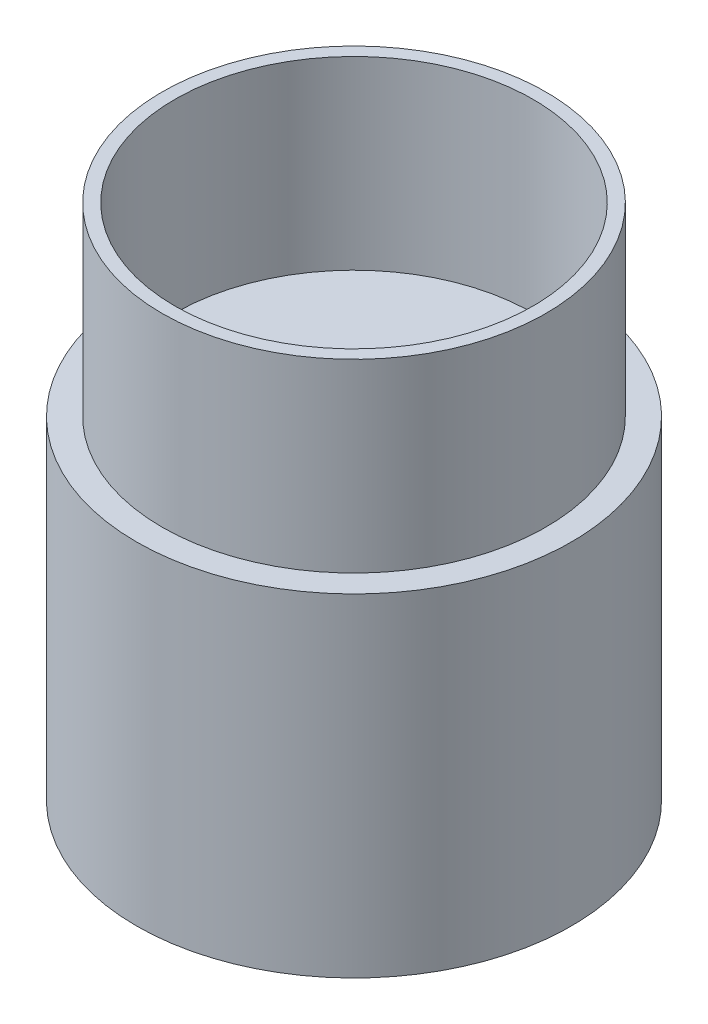
ISO-10303-21;
HEADER;
FILE_DESCRIPTION(('STEP AP214'),'2;1');
FILE_NAME('part.step','',(''),(''),'','','');
FILE_SCHEMA(('AUTOMOTIVE_DESIGN { 1 0 10303 214 1 1 1 1 }'));
ENDSEC;
DATA;
#1=APPLICATION_CONTEXT('core data for automotive mechanical design processes');
#2=APPLICATION_PROTOCOL_DEFINITION('international standard','automotive_design',2000,#1);
#3=PRODUCT_CONTEXT('',#1,'mechanical');
#4=PRODUCT('Part','Part','',(#3));
#5=PRODUCT_RELATED_PRODUCT_CATEGORY('part','',(#4));
#6=PRODUCT_DEFINITION_FORMATION('','',#4);
#7=PRODUCT_DEFINITION_CONTEXT('part definition',#1,'design');
#8=PRODUCT_DEFINITION('design','',#6,#7);
#9=PRODUCT_DEFINITION_SHAPE('','',#8);
#10=(LENGTH_UNIT() NAMED_UNIT(*) SI_UNIT(.MILLI.,.METRE.));
#11=(NAMED_UNIT(*) PLANE_ANGLE_UNIT() SI_UNIT($,.RADIAN.));
#12=(NAMED_UNIT(*) SI_UNIT($,.STERADIAN.) SOLID_ANGLE_UNIT());
#13=UNCERTAINTY_MEASURE_WITH_UNIT(LENGTH_MEASURE(1.E-05),#10,'distance_accuracy_value','');
#14=(GEOMETRIC_REPRESENTATION_CONTEXT(3) GLOBAL_UNCERTAINTY_ASSIGNED_CONTEXT((#13)) GLOBAL_UNIT_ASSIGNED_CONTEXT((#10,
#11,#12)) REPRESENTATION_CONTEXT('',''));
#15=CARTESIAN_POINT('',(0.,0.,0.));
#16=DIRECTION('',(0.,0.,1.));
#17=DIRECTION('',(1.,0.,0.));
#18=AXIS2_PLACEMENT_3D('',#15,#16,#17);
#19=CARTESIAN_POINT('',(0.,130.,0.));
#20=DIRECTION('',(0.,-1.,0.));
#21=DIRECTION('',(0.,0.,-1.));
#22=AXIS2_PLACEMENT_3D('',#19,#20,#21);
#23=CYLINDRICAL_SURFACE('',#22,85.);
#24=CARTESIAN_POINT('',(0.,130.,0.));
#25=DIRECTION('',(0.,1.,0.));
#26=DIRECTION('',(0.,0.,1.));
#27=AXIS2_PLACEMENT_3D('',#24,#25,#26);
#28=CIRCLE('',#27,85.);
#29=CARTESIAN_POINT('',(0.,130.,85.));
#30=VERTEX_POINT('',#29);
#31=EDGE_CURVE('E50',#30,#30,#28,.T.);
#32=ORIENTED_EDGE('',*,*,#31,.F.);
#33=EDGE_LOOP('',(#32));
#34=FACE_BOUND('',#33,.T.);
#35=CARTESIAN_POINT('',(0.,0.,0.));
#36=DIRECTION('',(0.,1.,0.));
#37=DIRECTION('',(0.,0.,1.));
#38=AXIS2_PLACEMENT_3D('',#35,#36,#37);
#39=CIRCLE('',#38,85.);
#40=CARTESIAN_POINT('',(0.,0.,85.));
#41=VERTEX_POINT('',#40);
#42=EDGE_CURVE('E55',#41,#41,#39,.T.);
#43=ORIENTED_EDGE('',*,*,#42,.T.);
#44=EDGE_LOOP('',(#43));
#45=FACE_BOUND('',#44,.T.);
#46=ADVANCED_FACE('F43',(#34,#45),#23,.T.);
#47=CARTESIAN_POINT('',(0.,130.,0.));
#48=DIRECTION('',(0.,1.,0.));
#49=DIRECTION('',(0.,0.,1.));
#50=AXIS2_PLACEMENT_3D('',#47,#48,#49);
#51=PLANE('',#50);
#52=CARTESIAN_POINT('',(0.,130.,0.));
#53=DIRECTION('',(0.,1.,0.));
#54=DIRECTION('',(0.,0.,1.));
#55=AXIS2_PLACEMENT_3D('',#52,#53,#54);
#56=CIRCLE('',#55,75.);
#57=CARTESIAN_POINT('',(0.,130.,75.));
#58=VERTEX_POINT('',#57);
#59=EDGE_CURVE('E71',#58,#58,#56,.T.);
#60=ORIENTED_EDGE('',*,*,#59,.F.);
#61=EDGE_LOOP('',(#60));
#62=FACE_BOUND('',#61,.T.);
#63=ORIENTED_EDGE('',*,*,#31,.T.);
#64=EDGE_LOOP('',(#63));
#65=FACE_BOUND('',#64,.T.);
#66=ADVANCED_FACE('F98',(#62,#65),#51,.T.);
#67=CARTESIAN_POINT('',(0.,0.,0.));
#68=DIRECTION('',(0.,1.,0.));
#69=DIRECTION('',(0.,0.,1.));
#70=AXIS2_PLACEMENT_3D('',#67,#68,#69);
#71=PLANE('',#70);
#72=ORIENTED_EDGE('',*,*,#42,.F.);
#73=EDGE_LOOP('',(#72));
#74=FACE_BOUND('',#73,.T.);
#75=ADVANCED_FACE('F88',(#74),#71,.F.);
#76=CARTESIAN_POINT('',(0.,202.35,0.));
#77=DIRECTION('',(0.,1.,0.));
#78=DIRECTION('',(0.,0.,1.));
#79=AXIS2_PLACEMENT_3D('',#76,#77,#78);
#80=PLANE('',#79);
#81=CARTESIAN_POINT('',(0.,202.35,0.));
#82=DIRECTION('',(0.,1.,0.));
#83=DIRECTION('',(0.,0.,1.));
#84=AXIS2_PLACEMENT_3D('',#81,#82,#83);
#85=CIRCLE('',#84,75.);
#86=CARTESIAN_POINT('',(0.,202.35,75.));
#87=VERTEX_POINT('',#86);
#88=EDGE_CURVE('E67',#87,#87,#85,.T.);
#89=ORIENTED_EDGE('',*,*,#88,.T.);
#90=EDGE_LOOP('',(#89));
#91=FACE_BOUND('',#90,.T.);
#92=CARTESIAN_POINT('',(0.,202.35,0.));
#93=DIRECTION('',(0.,1.,0.));
#94=DIRECTION('',(0.,0.,1.));
#95=AXIS2_PLACEMENT_3D('',#92,#93,#94);
#96=CIRCLE('',#95,70.);
#97=CARTESIAN_POINT('',(0.,202.35,70.));
#98=VERTEX_POINT('',#97);
#99=EDGE_CURVE('E75',#98,#98,#96,.T.);
#100=ORIENTED_EDGE('',*,*,#99,.F.);
#101=EDGE_LOOP('',(#100));
#102=FACE_BOUND('',#101,.T.);
#103=ADVANCED_FACE('F85',(#91,#102),#80,.T.);
#104=CARTESIAN_POINT('',(0.,202.35,0.));
#105=DIRECTION('',(0.,-1.,0.));
#106=DIRECTION('',(0.,0.,-1.));
#107=AXIS2_PLACEMENT_3D('',#104,#105,#106);
#108=CYLINDRICAL_SURFACE('',#107,75.);
#109=ORIENTED_EDGE('',*,*,#88,.F.);
#110=EDGE_LOOP('',(#109));
#111=FACE_BOUND('',#110,.T.);
#112=ORIENTED_EDGE('',*,*,#59,.T.);
#113=EDGE_LOOP('',(#112));
#114=FACE_BOUND('',#113,.T.);
#115=ADVANCED_FACE('F87',(#111,#114),#108,.T.);
#116=CARTESIAN_POINT('',(0.,202.35,0.));
#117=DIRECTION('',(0.,-1.,0.));
#118=DIRECTION('',(0.,0.,-1.));
#119=AXIS2_PLACEMENT_3D('',#116,#117,#118);
#120=CYLINDRICAL_SURFACE('',#119,70.);
#121=ORIENTED_EDGE('',*,*,#99,.T.);
#122=EDGE_LOOP('',(#121));
#123=FACE_BOUND('',#122,.T.);
#124=CARTESIAN_POINT('',(0.,130.,0.));
#125=DIRECTION('',(0.,1.,0.));
#126=DIRECTION('',(0.,0.,1.));
#127=AXIS2_PLACEMENT_3D('',#124,#125,#126);
#128=CIRCLE('',#127,70.);
#129=CARTESIAN_POINT('',(0.,130.,70.));
#130=VERTEX_POINT('',#129);
#131=EDGE_CURVE('E10',#130,#130,#128,.F.);
#132=ORIENTED_EDGE('',*,*,#131,.T.);
#133=EDGE_LOOP('',(#132));
#134=FACE_BOUND('',#133,.T.);
#135=ADVANCED_FACE('F83',(#123,#134),#120,.F.);
#136=CARTESIAN_POINT('',(0.,6.00000000000001,0.));
#137=DIRECTION('',(0.,1.,0.));
#138=DIRECTION('',(0.,0.,1.));
#139=AXIS2_PLACEMENT_3D('',#136,#137,#138);
#140=PLANE('',#139);
#141=CARTESIAN_POINT('',(0.,6.00000000000001,0.));
#142=DIRECTION('',(0.,1.,0.));
#143=DIRECTION('',(0.,0.,1.));
#144=AXIS2_PLACEMENT_3D('',#141,#142,#143);
#145=CIRCLE('',#144,26.);
#146=CARTESIAN_POINT('',(0.,6.00000000000001,26.));
#147=VERTEX_POINT('',#146);
#148=EDGE_CURVE('E61',#147,#147,#145,.T.);
#149=ORIENTED_EDGE('',*,*,#148,.T.);
#150=EDGE_LOOP('',(#149));
#151=FACE_BOUND('',#150,.T.);
#152=ADVANCED_FACE('F122',(#151),#140,.T.);
#153=CARTESIAN_POINT('',(0.,6.00000000000001,0.));
#154=DIRECTION('',(0.,1.,0.));
#155=DIRECTION('',(0.,0.,1.));
#156=AXIS2_PLACEMENT_3D('',#153,#154,#155);
#157=CYLINDRICAL_SURFACE('',#156,26.);
#158=ORIENTED_EDGE('',*,*,#148,.F.);
#159=EDGE_LOOP('',(#158));
#160=FACE_BOUND('',#159,.T.);
#161=CARTESIAN_POINT('',(0.,130.,0.));
#162=DIRECTION('',(0.,1.,0.));
#163=DIRECTION('',(0.,0.,1.));
#164=AXIS2_PLACEMENT_3D('',#161,#162,#163);
#165=CIRCLE('',#164,26.);
#166=CARTESIAN_POINT('',(0.,130.,26.));
#167=VERTEX_POINT('',#166);
#168=EDGE_CURVE('E63',#167,#167,#165,.T.);
#169=ORIENTED_EDGE('',*,*,#168,.T.);
#170=EDGE_LOOP('',(#169));
#171=FACE_BOUND('',#170,.T.);
#172=ADVANCED_FACE('F116',(#160,#171),#157,.F.);
#173=ORIENTED_EDGE('',*,*,#168,.F.);
#174=EDGE_LOOP('',(#173));
#175=FACE_BOUND('',#174,.T.);
#176=ORIENTED_EDGE('',*,*,#131,.F.);
#177=EDGE_LOOP('',(#176));
#178=FACE_BOUND('',#177,.T.);
#179=ADVANCED_FACE('F107',(#175,#178),#51,.T.);
#180=CLOSED_SHELL('',(#46,#66,#75,#103,#115,#135,#152,#172,#179));
#181=MANIFOLD_SOLID_BREP('B2',#180);
#182=ADVANCED_BREP_SHAPE_REPRESENTATION('',(#18,#181),#14);
#183=SHAPE_DEFINITION_REPRESENTATION(#9,#182);
ENDSEC;
END-ISO-10303-21;
